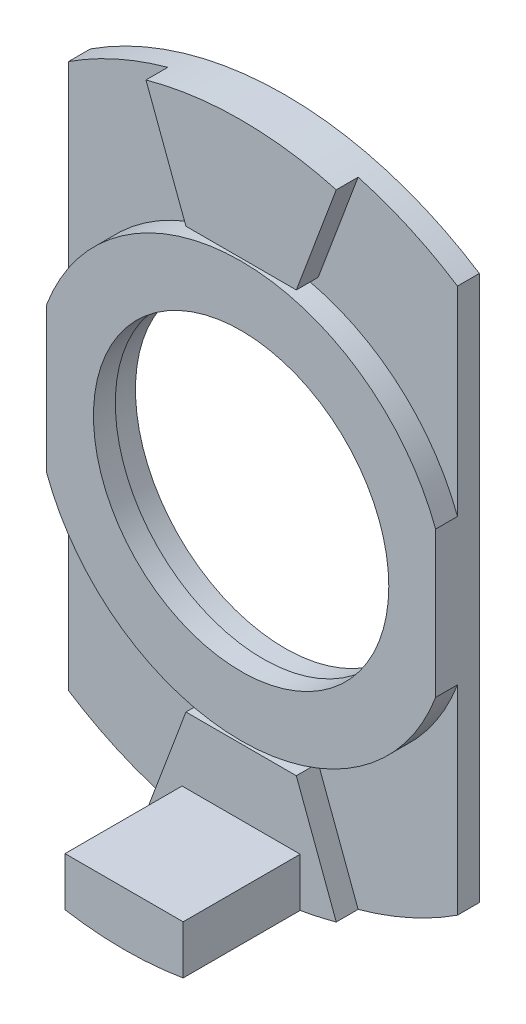
ISO-10303-21;
HEADER;
FILE_DESCRIPTION(('STEP AP214'),'2;1');
FILE_NAME('part.step','',(''),(''),'','','');
FILE_SCHEMA(('AUTOMOTIVE_DESIGN { 1 0 10303 214 1 1 1 1 }'));
ENDSEC;
DATA;
#1=APPLICATION_CONTEXT('core data for automotive mechanical design processes');
#2=APPLICATION_PROTOCOL_DEFINITION('international standard','automotive_design',2000,#1);
#3=PRODUCT_CONTEXT('',#1,'mechanical');
#4=PRODUCT('Part','Part','',(#3));
#5=PRODUCT_RELATED_PRODUCT_CATEGORY('part','',(#4));
#6=PRODUCT_DEFINITION_FORMATION('','',#4);
#7=PRODUCT_DEFINITION_CONTEXT('part definition',#1,'design');
#8=PRODUCT_DEFINITION('design','',#6,#7);
#9=PRODUCT_DEFINITION_SHAPE('','',#8);
#10=(LENGTH_UNIT() NAMED_UNIT(*) SI_UNIT(.MILLI.,.METRE.));
#11=(NAMED_UNIT(*) PLANE_ANGLE_UNIT() SI_UNIT($,.RADIAN.));
#12=(NAMED_UNIT(*) SI_UNIT($,.STERADIAN.) SOLID_ANGLE_UNIT());
#13=UNCERTAINTY_MEASURE_WITH_UNIT(LENGTH_MEASURE(1.E-05),#10,'distance_accuracy_value','');
#14=(GEOMETRIC_REPRESENTATION_CONTEXT(3) GLOBAL_UNCERTAINTY_ASSIGNED_CONTEXT((#13)) GLOBAL_UNIT_ASSIGNED_CONTEXT((#10,
#11,#12)) REPRESENTATION_CONTEXT('',''));
#15=CARTESIAN_POINT('',(0.,0.,0.));
#16=DIRECTION('',(0.,0.,1.));
#17=DIRECTION('',(1.,0.,0.));
#18=AXIS2_PLACEMENT_3D('',#15,#16,#17);
#19=CARTESIAN_POINT('',(0.,0.636052109545294,0.508));
#20=DIRECTION('',(0.,0.,-1.));
#21=DIRECTION('',(-1.,0.,0.));
#22=AXIS2_PLACEMENT_3D('',#19,#20,#21);
#23=PLANE('',#22);
#24=DIRECTION('',(-1.,0.,0.));
#25=VECTOR('',#24,1.);
#26=CARTESIAN_POINT('',(1.28140560740527,4.88403737082876,0.508));
#27=LINE('',#26,#25);
#28=CARTESIAN_POINT('',(1.28140560740527,4.88403737082876,0.508));
#29=VERTEX_POINT('',#28);
#30=CARTESIAN_POINT('',(-1.28140560740527,4.88403737082876,0.508));
#31=VERTEX_POINT('',#30);
#32=EDGE_CURVE('E47',#29,#31,#27,.T.);
#33=ORIENTED_EDGE('',*,*,#32,.T.);
#34=DIRECTION('',(-0.350658717365972,0.936503317631738,0.));
#35=VECTOR('',#34,1.);
#36=CARTESIAN_POINT('',(-2.20945708566231,7.36258202201928,0.508));
#37=LINE('',#36,#35);
#38=CARTESIAN_POINT('',(-2.20945708566231,7.36258202201928,0.508));
#39=VERTEX_POINT('',#38);
#40=EDGE_CURVE('E199',#31,#39,#37,.T.);
#41=ORIENTED_EDGE('',*,*,#40,.T.);
#42=CARTESIAN_POINT('',(0.,-0.636052109545295,0.508));
#43=DIRECTION('',(0.,0.,1.));
#44=DIRECTION('',(1.,0.,0.));
#45=AXIS2_PLACEMENT_3D('',#42,#43,#44);
#46=CIRCLE('',#45,8.29818345085315);
#47=CARTESIAN_POINT('',(-4.5160128225262,6.32566296439964,0.508));
#48=VERTEX_POINT('',#47);
#49=EDGE_CURVE('E176',#39,#48,#46,.T.);
#50=ORIENTED_EDGE('',*,*,#49,.T.);
#51=DIRECTION('',(0.,-1.,0.));
#52=VECTOR('',#51,1.);
#53=CARTESIAN_POINT('',(-4.5160128225262,6.32566296439964,0.508));
#54=LINE('',#53,#52);
#55=CARTESIAN_POINT('',(-4.5160128225262,1.69270465143286,0.508));
#56=VERTEX_POINT('',#55);
#57=EDGE_CURVE('E315',#48,#56,#54,.T.);
#58=ORIENTED_EDGE('',*,*,#57,.T.);
#59=CARTESIAN_POINT('',(0.,0.,0.508));
#60=DIRECTION('',(0.,0.,1.));
#61=DIRECTION('',(1.,0.,0.));
#62=AXIS2_PLACEMENT_3D('',#59,#60,#61);
#63=CIRCLE('',#62,4.82282291300474);
#64=CARTESIAN_POINT('',(4.5160128225262,1.69270465143286,0.508));
#65=VERTEX_POINT('',#64);
#66=EDGE_CURVE('E210',#65,#56,#63,.T.);
#67=ORIENTED_EDGE('',*,*,#66,.F.);
#68=DIRECTION('',(0.,1.,0.));
#69=VECTOR('',#68,1.);
#70=CARTESIAN_POINT('',(4.5160128225262,6.32566296439964,0.508));
#71=LINE('',#70,#69);
#72=CARTESIAN_POINT('',(4.5160128225262,6.32566296439964,0.508));
#73=VERTEX_POINT('',#72);
#74=EDGE_CURVE('E308',#65,#73,#71,.T.);
#75=ORIENTED_EDGE('',*,*,#74,.T.);
#76=CARTESIAN_POINT('',(2.20945708566231,7.36258202201928,0.508));
#77=VERTEX_POINT('',#76);
#78=EDGE_CURVE('E312',#73,#77,#46,.T.);
#79=ORIENTED_EDGE('',*,*,#78,.T.);
#80=DIRECTION('',(-0.350658717365972,-0.936503317631738,0.));
#81=VECTOR('',#80,1.);
#82=CARTESIAN_POINT('',(2.20945708566231,7.36258202201928,0.508));
#83=LINE('',#82,#81);
#84=EDGE_CURVE('E52',#77,#29,#83,.T.);
#85=ORIENTED_EDGE('',*,*,#84,.T.);
#86=EDGE_LOOP('',(#33,#41,#50,#58,#67,#75,#79,#85));
#87=FACE_BOUND('',#86,.T.);
#88=ADVANCED_FACE('F32',(#87),#23,.F.);
#89=CARTESIAN_POINT('',(0.,0.,0.508));
#90=DIRECTION('',(0.,0.,1.));
#91=DIRECTION('',(1.,0.,0.));
#92=AXIS2_PLACEMENT_3D('',#89,#90,#91);
#93=CIRCLE('',#92,4.82282291300474);
#94=CARTESIAN_POINT('',(-4.5160128225262,-1.69270465143286,0.508));
#95=VERTEX_POINT('',#94);
#96=CARTESIAN_POINT('',(4.5160128225262,-1.69270465143286,0.508));
#97=VERTEX_POINT('',#96);
#98=EDGE_CURVE('E217',#95,#97,#93,.T.);
#99=ORIENTED_EDGE('',*,*,#98,.F.);
#100=CARTESIAN_POINT('',(-4.5160128225262,-6.32566296439964,0.508));
#101=VERTEX_POINT('',#100);
#102=EDGE_CURVE('E314',#95,#101,#54,.T.);
#103=ORIENTED_EDGE('',*,*,#102,.T.);
#104=CARTESIAN_POINT('',(0.,0.636052109545294,0.508));
#105=DIRECTION('',(0.,0.,1.));
#106=DIRECTION('',(-1.,0.,0.));
#107=AXIS2_PLACEMENT_3D('',#104,#105,#106);
#108=CIRCLE('',#107,8.29818345085315);
#109=CARTESIAN_POINT('',(-2.20945708566231,-7.36258202201928,0.508));
#110=VERTEX_POINT('',#109);
#111=EDGE_CURVE('E306',#101,#110,#108,.T.);
#112=ORIENTED_EDGE('',*,*,#111,.T.);
#113=DIRECTION('',(-0.350658717365972,-0.936503317631738,0.));
#114=VECTOR('',#113,1.);
#115=CARTESIAN_POINT('',(-2.20945708566231,-7.36258202201928,0.508));
#116=LINE('',#115,#114);
#117=CARTESIAN_POINT('',(-1.28140560740527,-4.88403737082876,0.508));
#118=VERTEX_POINT('',#117);
#119=EDGE_CURVE('E288',#118,#110,#116,.T.);
#120=ORIENTED_EDGE('',*,*,#119,.F.);
#121=DIRECTION('',(-1.,0.,0.));
#122=VECTOR('',#121,1.);
#123=CARTESIAN_POINT('',(1.28140560740527,-4.88403737082876,0.508));
#124=LINE('',#123,#122);
#125=CARTESIAN_POINT('',(1.28140560740527,-4.88403737082876,0.508));
#126=VERTEX_POINT('',#125);
#127=EDGE_CURVE('E285',#126,#118,#124,.T.);
#128=ORIENTED_EDGE('',*,*,#127,.F.);
#129=DIRECTION('',(-0.350658717365972,0.936503317631738,0.));
#130=VECTOR('',#129,1.);
#131=CARTESIAN_POINT('',(2.20945708566231,-7.36258202201928,0.508));
#132=LINE('',#131,#130);
#133=CARTESIAN_POINT('',(2.20945708566231,-7.36258202201928,0.508));
#134=VERTEX_POINT('',#133);
#135=EDGE_CURVE('E272',#134,#126,#132,.T.);
#136=ORIENTED_EDGE('',*,*,#135,.F.);
#137=CARTESIAN_POINT('',(4.5160128225262,-6.32566296439964,0.508));
#138=VERTEX_POINT('',#137);
#139=EDGE_CURVE('E309',#134,#138,#108,.T.);
#140=ORIENTED_EDGE('',*,*,#139,.T.);
#141=EDGE_CURVE('E310',#138,#97,#71,.T.);
#142=ORIENTED_EDGE('',*,*,#141,.T.);
#143=EDGE_LOOP('',(#99,#103,#112,#120,#128,#136,#140,#142));
#144=FACE_BOUND('',#143,.T.);
#145=ADVANCED_FACE('F352',(#144),#23,.F.);
#146=CARTESIAN_POINT('',(0.,0.63605210954584,1.016));
#147=DIRECTION('',(0.,0.,-1.));
#148=DIRECTION('',(-1.,0.,0.));
#149=AXIS2_PLACEMENT_3D('',#146,#147,#148);
#150=PLANE('',#149);
#151=DIRECTION('',(0.,-1.,0.));
#152=VECTOR('',#151,1.);
#153=CARTESIAN_POINT('',(-1.3716,-7.54799102475044,1.016));
#154=LINE('',#153,#152);
#155=CARTESIAN_POINT('',(-1.3716,-6.41769102475044,1.016));
#156=VERTEX_POINT('',#155);
#157=CARTESIAN_POINT('',(-1.3716,-7.54799102475043,1.016));
#158=VERTEX_POINT('',#157);
#159=EDGE_CURVE('E247',#156,#158,#154,.T.);
#160=ORIENTED_EDGE('',*,*,#159,.F.);
#161=DIRECTION('',(-1.,0.,0.));
#162=VECTOR('',#161,1.);
#163=CARTESIAN_POINT('',(-1.3716,-6.41769102475044,1.016));
#164=LINE('',#163,#162);
#165=CARTESIAN_POINT('',(1.3716,-6.41769102475044,1.016));
#166=VERTEX_POINT('',#165);
#167=EDGE_CURVE('E256',#166,#156,#164,.T.);
#168=ORIENTED_EDGE('',*,*,#167,.F.);
#169=DIRECTION('',(0.,1.,0.));
#170=VECTOR('',#169,1.);
#171=CARTESIAN_POINT('',(1.3716,-6.41769102475044,1.016));
#172=LINE('',#171,#170);
#173=CARTESIAN_POINT('',(1.3716,-7.54799102475043,1.016));
#174=VERTEX_POINT('',#173);
#175=EDGE_CURVE('E242',#174,#166,#172,.T.);
#176=ORIENTED_EDGE('',*,*,#175,.F.);
#177=CARTESIAN_POINT('',(0.,0.63605210954584,1.016));
#178=DIRECTION('',(0.,0.,1.));
#179=DIRECTION('',(-1.,0.,0.));
#180=AXIS2_PLACEMENT_3D('',#177,#178,#179);
#181=CIRCLE('',#180,8.29818345085368);
#182=CARTESIAN_POINT('',(2.20945708566231,-7.36258202201928,1.016));
#183=VERTEX_POINT('',#182);
#184=EDGE_CURVE('E276',#174,#183,#181,.T.);
#185=ORIENTED_EDGE('',*,*,#184,.T.);
#186=DIRECTION('',(-0.350658717365972,0.936503317631738,0.));
#187=VECTOR('',#186,1.);
#188=CARTESIAN_POINT('',(2.20945708566231,-7.36258202201928,1.016));
#189=LINE('',#188,#187);
#190=CARTESIAN_POINT('',(1.28140560740527,-4.88403737082876,1.016));
#191=VERTEX_POINT('',#190);
#192=EDGE_CURVE('E275',#183,#191,#189,.T.);
#193=ORIENTED_EDGE('',*,*,#192,.T.);
#194=DIRECTION('',(-1.,0.,0.));
#195=VECTOR('',#194,1.);
#196=CARTESIAN_POINT('',(1.28140560740527,-4.88403737082876,1.016));
#197=LINE('',#196,#195);
#198=CARTESIAN_POINT('',(-1.28140560740527,-4.88403737082876,1.016));
#199=VERTEX_POINT('',#198);
#200=EDGE_CURVE('E278',#191,#199,#197,.T.);
#201=ORIENTED_EDGE('',*,*,#200,.T.);
#202=DIRECTION('',(-0.350658717365972,-0.936503317631738,0.));
#203=VECTOR('',#202,1.);
#204=CARTESIAN_POINT('',(-2.20945708566231,-7.36258202201928,1.016));
#205=LINE('',#204,#203);
#206=CARTESIAN_POINT('',(-2.20945708566231,-7.36258202201928,1.016));
#207=VERTEX_POINT('',#206);
#208=EDGE_CURVE('E280',#199,#207,#205,.T.);
#209=ORIENTED_EDGE('',*,*,#208,.T.);
#210=EDGE_CURVE('E273',#207,#158,#181,.T.);
#211=ORIENTED_EDGE('',*,*,#210,.T.);
#212=EDGE_LOOP('',(#160,#168,#176,#185,#193,#201,#209,#211));
#213=FACE_BOUND('',#212,.T.);
#214=ADVANCED_FACE('F404',(#213),#150,.F.);
#215=CARTESIAN_POINT('',(0.,0.636052109545294,0.));
#216=DIRECTION('',(0.,0.,-1.));
#217=DIRECTION('',(-1.,0.,0.));
#218=AXIS2_PLACEMENT_3D('',#215,#216,#217);
#219=PLANE('',#218);
#220=CARTESIAN_POINT('',(0.,0.636052109545294,0.));
#221=DIRECTION('',(0.,0.,1.));
#222=DIRECTION('',(-1.,0.,0.));
#223=AXIS2_PLACEMENT_3D('',#220,#221,#222);
#224=CIRCLE('',#223,8.29818345085315);
#225=CARTESIAN_POINT('',(-4.5160128225262,-6.32566296439964,0.));
#226=VERTEX_POINT('',#225);
#227=CARTESIAN_POINT('',(4.5160128225262,-6.32566296439964,0.));
#228=VERTEX_POINT('',#227);
#229=EDGE_CURVE('E305',#226,#228,#224,.T.);
#230=ORIENTED_EDGE('',*,*,#229,.F.);
#231=DIRECTION('',(0.,-1.,0.));
#232=VECTOR('',#231,1.);
#233=CARTESIAN_POINT('',(-4.5160128225262,6.32566296439964,0.));
#234=LINE('',#233,#232);
#235=CARTESIAN_POINT('',(-4.5160128225262,6.32566296439964,0.));
#236=VERTEX_POINT('',#235);
#237=EDGE_CURVE('E324',#236,#226,#234,.T.);
#238=ORIENTED_EDGE('',*,*,#237,.F.);
#239=CARTESIAN_POINT('',(0.,-0.636052109545295,0.));
#240=DIRECTION('',(0.,0.,1.));
#241=DIRECTION('',(1.,0.,0.));
#242=AXIS2_PLACEMENT_3D('',#239,#240,#241);
#243=CIRCLE('',#242,8.29818345085315);
#244=CARTESIAN_POINT('',(4.5160128225262,6.32566296439964,0.));
#245=VERTEX_POINT('',#244);
#246=EDGE_CURVE('E322',#245,#236,#243,.T.);
#247=ORIENTED_EDGE('',*,*,#246,.F.);
#248=DIRECTION('',(0.,1.,0.));
#249=VECTOR('',#248,1.);
#250=CARTESIAN_POINT('',(4.5160128225262,6.32566296439964,0.));
#251=LINE('',#250,#249);
#252=EDGE_CURVE('E320',#228,#245,#251,.T.);
#253=ORIENTED_EDGE('',*,*,#252,.F.);
#254=EDGE_LOOP('',(#230,#238,#247,#253));
#255=FACE_BOUND('',#254,.T.);
#256=CARTESIAN_POINT('',(0.,0.,0.));
#257=DIRECTION('',(0.,0.,1.));
#258=DIRECTION('',(1.,0.,0.));
#259=AXIS2_PLACEMENT_3D('',#256,#257,#258);
#260=CIRCLE('',#259,3.46997414662655);
#261=CARTESIAN_POINT('',(3.46997414662655,0.,0.));
#262=VERTEX_POINT('',#261);
#263=EDGE_CURVE('E302',#262,#262,#260,.T.);
#264=ORIENTED_EDGE('',*,*,#263,.T.);
#265=EDGE_LOOP('',(#264));
#266=FACE_BOUND('',#265,.T.);
#267=ADVANCED_FACE('F339',(#255,#266),#219,.T.);
#268=CARTESIAN_POINT('',(0.,0.636052109545294,0.508));
#269=DIRECTION('',(0.,0.,-1.));
#270=DIRECTION('',(-1.,0.,0.));
#271=AXIS2_PLACEMENT_3D('',#268,#269,#270);
#272=CYLINDRICAL_SURFACE('',#271,8.29818345085315);
#273=ORIENTED_EDGE('',*,*,#229,.T.);
#274=DIRECTION('',(0.,0.,-1.));
#275=VECTOR('',#274,1.);
#276=CARTESIAN_POINT('',(4.5160128225262,-6.32566296439964,0.508));
#277=LINE('',#276,#275);
#278=EDGE_CURVE('E11',#138,#228,#277,.T.);
#279=ORIENTED_EDGE('',*,*,#278,.F.);
#280=ORIENTED_EDGE('',*,*,#139,.F.);
#281=DIRECTION('',(0.,0.,-1.));
#282=VECTOR('',#281,1.);
#283=CARTESIAN_POINT('',(2.20945708566231,-7.36258202201928,1.016));
#284=LINE('',#283,#282);
#285=EDGE_CURVE('E299',#183,#134,#284,.T.);
#286=ORIENTED_EDGE('',*,*,#285,.F.);
#287=ORIENTED_EDGE('',*,*,#184,.F.);
#288=DIRECTION('',(0.,0.,-1.));
#289=VECTOR('',#288,1.);
#290=CARTESIAN_POINT('',(1.3716,-7.54799102475044,3.7338));
#291=LINE('',#290,#289);
#292=CARTESIAN_POINT('',(1.3716,-7.54799102475044,3.7338));
#293=VERTEX_POINT('',#292);
#294=EDGE_CURVE('E269',#293,#174,#291,.T.);
#295=ORIENTED_EDGE('',*,*,#294,.F.);
#296=CARTESIAN_POINT('',(0.,0.636052109545839,3.7338));
#297=DIRECTION('',(0.,0.,1.));
#298=DIRECTION('',(1.,0.,0.));
#299=AXIS2_PLACEMENT_3D('',#296,#297,#298);
#300=CIRCLE('',#299,8.29818345085368);
#301=CARTESIAN_POINT('',(-1.3716,-7.54799102475044,3.7338));
#302=VERTEX_POINT('',#301);
#303=EDGE_CURVE('E243',#302,#293,#300,.T.);
#304=ORIENTED_EDGE('',*,*,#303,.F.);
#305=DIRECTION('',(0.,0.,-1.));
#306=VECTOR('',#305,1.);
#307=CARTESIAN_POINT('',(-1.3716,-7.54799102475044,3.7338));
#308=LINE('',#307,#306);
#309=EDGE_CURVE('E253',#302,#158,#308,.T.);
#310=ORIENTED_EDGE('',*,*,#309,.T.);
#311=ORIENTED_EDGE('',*,*,#210,.F.);
#312=DIRECTION('',(0.,0.,-1.));
#313=VECTOR('',#312,1.);
#314=CARTESIAN_POINT('',(-2.20945708566231,-7.36258202201928,1.016));
#315=LINE('',#314,#313);
#316=EDGE_CURVE('E282',#207,#110,#315,.T.);
#317=ORIENTED_EDGE('',*,*,#316,.T.);
#318=ORIENTED_EDGE('',*,*,#111,.F.);
#319=DIRECTION('',(0.,0.,-1.));
#320=VECTOR('',#319,1.);
#321=CARTESIAN_POINT('',(-4.5160128225262,-6.32566296439964,0.508));
#322=LINE('',#321,#320);
#323=EDGE_CURVE('E317',#101,#226,#322,.T.);
#324=ORIENTED_EDGE('',*,*,#323,.T.);
#325=EDGE_LOOP('',(#273,#279,#280,#286,#287,#295,#304,#310,#311,#317,#318,#324));
#326=FACE_BOUND('',#325,.T.);
#327=ADVANCED_FACE('F34',(#326),#272,.T.);
#328=CARTESIAN_POINT('',(4.5160128225262,6.32566296439964,0.508));
#329=DIRECTION('',(-1.,0.,0.));
#330=DIRECTION('',(0.,-1.,0.));
#331=AXIS2_PLACEMENT_3D('',#328,#329,#330);
#332=PLANE('',#331);
#333=ORIENTED_EDGE('',*,*,#252,.T.);
#334=DIRECTION('',(0.,0.,-1.));
#335=VECTOR('',#334,1.);
#336=CARTESIAN_POINT('',(4.5160128225262,6.32566296439964,0.508));
#337=LINE('',#336,#335);
#338=EDGE_CURVE('E40',#73,#245,#337,.T.);
#339=ORIENTED_EDGE('',*,*,#338,.F.);
#340=ORIENTED_EDGE('',*,*,#74,.F.);
#341=DIRECTION('',(0.,0.,-1.));
#342=VECTOR('',#341,1.);
#343=CARTESIAN_POINT('',(4.5160128225262,1.69270465143286,1.016));
#344=LINE('',#343,#342);
#345=CARTESIAN_POINT('',(4.5160128225262,1.69270465143286,1.016));
#346=VERTEX_POINT('',#345);
#347=EDGE_CURVE('E223',#346,#65,#344,.T.);
#348=ORIENTED_EDGE('',*,*,#347,.F.);
#349=DIRECTION('',(0.,1.,0.));
#350=VECTOR('',#349,1.);
#351=CARTESIAN_POINT('',(4.5160128225262,-1.69270465143286,1.016));
#352=LINE('',#351,#350);
#353=CARTESIAN_POINT('',(4.5160128225262,-1.69270465143286,1.016));
#354=VERTEX_POINT('',#353);
#355=EDGE_CURVE('E221',#354,#346,#352,.T.);
#356=ORIENTED_EDGE('',*,*,#355,.F.);
#357=DIRECTION('',(0.,0.,-1.));
#358=VECTOR('',#357,1.);
#359=CARTESIAN_POINT('',(4.5160128225262,-1.69270465143286,1.016));
#360=LINE('',#359,#358);
#361=EDGE_CURVE('E230',#354,#97,#360,.T.);
#362=ORIENTED_EDGE('',*,*,#361,.T.);
#363=ORIENTED_EDGE('',*,*,#141,.F.);
#364=ORIENTED_EDGE('',*,*,#278,.T.);
#365=EDGE_LOOP('',(#333,#339,#340,#348,#356,#362,#363,#364));
#366=FACE_BOUND('',#365,.T.);
#367=ADVANCED_FACE('F369',(#366),#332,.F.);
#368=CARTESIAN_POINT('',(0.,-0.636052109545295,0.508));
#369=DIRECTION('',(0.,0.,-1.));
#370=DIRECTION('',(-1.,0.,0.));
#371=AXIS2_PLACEMENT_3D('',#368,#369,#370);
#372=CYLINDRICAL_SURFACE('',#371,8.29818345085315);
#373=ORIENTED_EDGE('',*,*,#246,.T.);
#374=DIRECTION('',(0.,0.,-1.));
#375=VECTOR('',#374,1.);
#376=CARTESIAN_POINT('',(-4.5160128225262,6.32566296439964,0.508));
#377=LINE('',#376,#375);
#378=EDGE_CURVE('E328',#48,#236,#377,.T.);
#379=ORIENTED_EDGE('',*,*,#378,.F.);
#380=ORIENTED_EDGE('',*,*,#49,.F.);
#381=DIRECTION('',(0.,0.,-1.));
#382=VECTOR('',#381,1.);
#383=CARTESIAN_POINT('',(-2.20945708566231,7.36258202201928,1.016));
#384=LINE('',#383,#382);
#385=CARTESIAN_POINT('',(-2.20945708566231,7.36258202201928,1.016));
#386=VERTEX_POINT('',#385);
#387=EDGE_CURVE('E169',#386,#39,#384,.T.);
#388=ORIENTED_EDGE('',*,*,#387,.F.);
#389=CARTESIAN_POINT('',(0.,-0.63605210954584,1.016));
#390=DIRECTION('',(0.,0.,-1.));
#391=DIRECTION('',(-1.,0.,0.));
#392=AXIS2_PLACEMENT_3D('',#389,#390,#391);
#393=CIRCLE('',#392,8.29818345085368);
#394=CARTESIAN_POINT('',(2.20945708566231,7.36258202201928,1.016));
#395=VERTEX_POINT('',#394);
#396=EDGE_CURVE('E173',#386,#395,#393,.T.);
#397=ORIENTED_EDGE('',*,*,#396,.T.);
#398=DIRECTION('',(0.,0.,-1.));
#399=VECTOR('',#398,1.);
#400=CARTESIAN_POINT('',(2.20945708566231,7.36258202201928,1.016));
#401=LINE('',#400,#399);
#402=EDGE_CURVE('E198',#395,#77,#401,.T.);
#403=ORIENTED_EDGE('',*,*,#402,.T.);
#404=ORIENTED_EDGE('',*,*,#78,.F.);
#405=ORIENTED_EDGE('',*,*,#338,.T.);
#406=EDGE_LOOP('',(#373,#379,#380,#388,#397,#403,#404,#405));
#407=FACE_BOUND('',#406,.T.);
#408=ADVANCED_FACE('F171',(#407),#372,.T.);
#409=CARTESIAN_POINT('',(-4.5160128225262,6.32566296439964,0.508));
#410=DIRECTION('',(1.,0.,0.));
#411=DIRECTION('',(0.,0.,-1.));
#412=AXIS2_PLACEMENT_3D('',#409,#410,#411);
#413=PLANE('',#412);
#414=ORIENTED_EDGE('',*,*,#237,.T.);
#415=ORIENTED_EDGE('',*,*,#323,.F.);
#416=ORIENTED_EDGE('',*,*,#102,.F.);
#417=DIRECTION('',(0.,0.,-1.));
#418=VECTOR('',#417,1.);
#419=CARTESIAN_POINT('',(-4.5160128225262,-1.69270465143286,1.016));
#420=LINE('',#419,#418);
#421=CARTESIAN_POINT('',(-4.5160128225262,-1.69270465143286,1.016));
#422=VERTEX_POINT('',#421);
#423=EDGE_CURVE('E233',#422,#95,#420,.T.);
#424=ORIENTED_EDGE('',*,*,#423,.F.);
#425=DIRECTION('',(0.,-1.,0.));
#426=VECTOR('',#425,1.);
#427=CARTESIAN_POINT('',(-4.5160128225262,1.69270465143286,1.016));
#428=LINE('',#427,#426);
#429=CARTESIAN_POINT('',(-4.5160128225262,1.69270465143286,1.016));
#430=VERTEX_POINT('',#429);
#431=EDGE_CURVE('E216',#430,#422,#428,.T.);
#432=ORIENTED_EDGE('',*,*,#431,.F.);
#433=DIRECTION('',(0.,0.,-1.));
#434=VECTOR('',#433,1.);
#435=CARTESIAN_POINT('',(-4.5160128225262,1.69270465143286,1.016));
#436=LINE('',#435,#434);
#437=EDGE_CURVE('E236',#430,#56,#436,.T.);
#438=ORIENTED_EDGE('',*,*,#437,.T.);
#439=ORIENTED_EDGE('',*,*,#57,.F.);
#440=ORIENTED_EDGE('',*,*,#378,.T.);
#441=EDGE_LOOP('',(#414,#415,#416,#424,#432,#438,#439,#440));
#442=FACE_BOUND('',#441,.T.);
#443=ADVANCED_FACE('F343',(#442),#413,.F.);
#444=CARTESIAN_POINT('',(0.,0.,0.508));
#445=DIRECTION('',(0.,0.,-1.));
#446=DIRECTION('',(-1.,0.,0.));
#447=AXIS2_PLACEMENT_3D('',#444,#445,#446);
#448=CYLINDRICAL_SURFACE('',#447,3.46997414662655);
#449=CARTESIAN_POINT('',(0.,0.,0.508));
#450=DIRECTION('',(0.,0.,1.));
#451=DIRECTION('',(1.,0.,0.));
#452=AXIS2_PLACEMENT_3D('',#449,#450,#451);
#453=CIRCLE('',#452,3.46997414662655);
#454=CARTESIAN_POINT('',(3.46997414662655,0.,0.508));
#455=VERTEX_POINT('',#454);
#456=EDGE_CURVE('E239',#455,#455,#453,.T.);
#457=ORIENTED_EDGE('',*,*,#456,.T.);
#458=EDGE_LOOP('',(#457));
#459=FACE_BOUND('',#458,.T.);
#460=ORIENTED_EDGE('',*,*,#263,.F.);
#461=EDGE_LOOP('',(#460));
#462=FACE_BOUND('',#461,.T.);
#463=ADVANCED_FACE('F407',(#459,#462),#448,.F.);
#464=CARTESIAN_POINT('',(2.20945708566231,-7.36258202201928,1.016));
#465=DIRECTION('',(-0.936503317631738,-0.350658717365972,0.));
#466=DIRECTION('',(0.350658717365972,-0.936503317631738,0.));
#467=AXIS2_PLACEMENT_3D('',#464,#465,#466);
#468=PLANE('',#467);
#469=ORIENTED_EDGE('',*,*,#135,.T.);
#470=DIRECTION('',(0.,0.,-1.));
#471=VECTOR('',#470,1.);
#472=CARTESIAN_POINT('',(1.28140560740527,-4.88403737082876,1.016));
#473=LINE('',#472,#471);
#474=EDGE_CURVE('E296',#191,#126,#473,.T.);
#475=ORIENTED_EDGE('',*,*,#474,.F.);
#476=ORIENTED_EDGE('',*,*,#192,.F.);
#477=ORIENTED_EDGE('',*,*,#285,.T.);
#478=EDGE_LOOP('',(#469,#475,#476,#477));
#479=FACE_BOUND('',#478,.T.);
#480=ADVANCED_FACE('F363',(#479),#468,.F.);
#481=CARTESIAN_POINT('',(1.28140560740527,-4.88403737082876,1.016));
#482=DIRECTION('',(0.,-1.,0.));
#483=DIRECTION('',(0.,0.,-1.));
#484=AXIS2_PLACEMENT_3D('',#481,#482,#483);
#485=PLANE('',#484);
#486=ORIENTED_EDGE('',*,*,#127,.T.);
#487=DIRECTION('',(0.,0.,-1.));
#488=VECTOR('',#487,1.);
#489=CARTESIAN_POINT('',(-1.28140560740527,-4.88403737082876,1.016));
#490=LINE('',#489,#488);
#491=EDGE_CURVE('E293',#199,#118,#490,.T.);
#492=ORIENTED_EDGE('',*,*,#491,.F.);
#493=ORIENTED_EDGE('',*,*,#200,.F.);
#494=ORIENTED_EDGE('',*,*,#474,.T.);
#495=EDGE_LOOP('',(#486,#492,#493,#494));
#496=FACE_BOUND('',#495,.T.);
#497=ADVANCED_FACE('F359',(#496),#485,.F.);
#498=CARTESIAN_POINT('',(-2.20945708566231,-7.36258202201928,1.016));
#499=DIRECTION('',(0.936503317631738,-0.350658717365972,0.));
#500=DIRECTION('',(0.350658717365972,0.936503317631738,0.));
#501=AXIS2_PLACEMENT_3D('',#498,#499,#500);
#502=PLANE('',#501);
#503=ORIENTED_EDGE('',*,*,#119,.T.);
#504=ORIENTED_EDGE('',*,*,#316,.F.);
#505=ORIENTED_EDGE('',*,*,#208,.F.);
#506=ORIENTED_EDGE('',*,*,#491,.T.);
#507=EDGE_LOOP('',(#503,#504,#505,#506));
#508=FACE_BOUND('',#507,.T.);
#509=ADVANCED_FACE('F354',(#508),#502,.F.);
#510=CARTESIAN_POINT('',(1.3716,-6.41769102475044,3.7338));
#511=DIRECTION('',(-1.,0.,0.));
#512=DIRECTION('',(0.,0.,1.));
#513=AXIS2_PLACEMENT_3D('',#510,#511,#512);
#514=PLANE('',#513);
#515=ORIENTED_EDGE('',*,*,#175,.T.);
#516=DIRECTION('',(0.,0.,-1.));
#517=VECTOR('',#516,1.);
#518=CARTESIAN_POINT('',(1.3716,-6.41769102475044,3.7338));
#519=LINE('',#518,#517);
#520=CARTESIAN_POINT('',(1.3716,-6.41769102475044,3.7338));
#521=VERTEX_POINT('',#520);
#522=EDGE_CURVE('E266',#521,#166,#519,.T.);
#523=ORIENTED_EDGE('',*,*,#522,.F.);
#524=DIRECTION('',(0.,1.,0.));
#525=VECTOR('',#524,1.);
#526=CARTESIAN_POINT('',(1.3716,-6.41769102475044,3.7338));
#527=LINE('',#526,#525);
#528=EDGE_CURVE('E246',#293,#521,#527,.T.);
#529=ORIENTED_EDGE('',*,*,#528,.F.);
#530=ORIENTED_EDGE('',*,*,#294,.T.);
#531=EDGE_LOOP('',(#515,#523,#529,#530));
#532=FACE_BOUND('',#531,.T.);
#533=ADVANCED_FACE('F449',(#532),#514,.F.);
#534=CARTESIAN_POINT('',(-1.3716,-6.41769102475044,3.7338));
#535=DIRECTION('',(0.,-1.,0.));
#536=DIRECTION('',(0.,0.,-1.));
#537=AXIS2_PLACEMENT_3D('',#534,#535,#536);
#538=PLANE('',#537);
#539=ORIENTED_EDGE('',*,*,#167,.T.);
#540=DIRECTION('',(0.,0.,-1.));
#541=VECTOR('',#540,1.);
#542=CARTESIAN_POINT('',(-1.3716,-6.41769102475044,3.7338));
#543=LINE('',#542,#541);
#544=CARTESIAN_POINT('',(-1.3716,-6.41769102475044,3.7338));
#545=VERTEX_POINT('',#544);
#546=EDGE_CURVE('E263',#545,#156,#543,.T.);
#547=ORIENTED_EDGE('',*,*,#546,.F.);
#548=DIRECTION('',(-1.,0.,0.));
#549=VECTOR('',#548,1.);
#550=CARTESIAN_POINT('',(-1.3716,-6.41769102475044,3.7338));
#551=LINE('',#550,#549);
#552=EDGE_CURVE('E249',#521,#545,#551,.T.);
#553=ORIENTED_EDGE('',*,*,#552,.F.);
#554=ORIENTED_EDGE('',*,*,#522,.T.);
#555=EDGE_LOOP('',(#539,#547,#553,#554));
#556=FACE_BOUND('',#555,.T.);
#557=ADVANCED_FACE('F455',(#556),#538,.F.);
#558=CARTESIAN_POINT('',(-1.3716,-7.54799102475044,3.7338));
#559=DIRECTION('',(1.,0.,0.));
#560=DIRECTION('',(0.,0.,-1.));
#561=AXIS2_PLACEMENT_3D('',#558,#559,#560);
#562=PLANE('',#561);
#563=ORIENTED_EDGE('',*,*,#159,.T.);
#564=ORIENTED_EDGE('',*,*,#309,.F.);
#565=DIRECTION('',(0.,-1.,0.));
#566=VECTOR('',#565,1.);
#567=CARTESIAN_POINT('',(-1.3716,-7.54799102475044,3.7338));
#568=LINE('',#567,#566);
#569=EDGE_CURVE('E251',#545,#302,#568,.T.);
#570=ORIENTED_EDGE('',*,*,#569,.F.);
#571=ORIENTED_EDGE('',*,*,#546,.T.);
#572=EDGE_LOOP('',(#563,#564,#570,#571));
#573=FACE_BOUND('',#572,.T.);
#574=ADVANCED_FACE('F463',(#573),#562,.F.);
#575=CARTESIAN_POINT('',(0.,0.636052109545839,3.7338));
#576=DIRECTION('',(0.,0.,1.));
#577=DIRECTION('',(1.,0.,0.));
#578=AXIS2_PLACEMENT_3D('',#575,#576,#577);
#579=PLANE('',#578);
#580=ORIENTED_EDGE('',*,*,#303,.T.);
#581=ORIENTED_EDGE('',*,*,#528,.T.);
#582=ORIENTED_EDGE('',*,*,#552,.T.);
#583=ORIENTED_EDGE('',*,*,#569,.T.);
#584=EDGE_LOOP('',(#580,#581,#582,#583));
#585=FACE_BOUND('',#584,.T.);
#586=ADVANCED_FACE('F471',(#585),#579,.T.);
#587=CARTESIAN_POINT('',(0.,0.,0.508));
#588=DIRECTION('',(0.,0.,1.));
#589=DIRECTION('',(1.,0.,0.));
#590=AXIS2_PLACEMENT_3D('',#587,#588,#589);
#591=PLANE('',#590);
#592=CARTESIAN_POINT('',(0.,0.,0.508));
#593=DIRECTION('',(0.,0.,1.));
#594=DIRECTION('',(1.,0.,0.));
#595=AXIS2_PLACEMENT_3D('',#592,#593,#594);
#596=CIRCLE('',#595,3.429);
#597=CARTESIAN_POINT('',(3.429,0.,0.508));
#598=VERTEX_POINT('',#597);
#599=EDGE_CURVE('E180',#598,#598,#596,.T.);
#600=ORIENTED_EDGE('',*,*,#599,.T.);
#601=EDGE_LOOP('',(#600));
#602=FACE_BOUND('',#601,.T.);
#603=ORIENTED_EDGE('',*,*,#456,.F.);
#604=EDGE_LOOP('',(#603));
#605=FACE_BOUND('',#604,.T.);
#606=ADVANCED_FACE('F479',(#602,#605),#591,.F.);
#607=CARTESIAN_POINT('',(0.,0.,1.016));
#608=DIRECTION('',(0.,0.,1.));
#609=DIRECTION('',(1.,0.,0.));
#610=AXIS2_PLACEMENT_3D('',#607,#608,#609);
#611=PLANE('',#610);
#612=CARTESIAN_POINT('',(0.,0.,1.016));
#613=DIRECTION('',(0.,0.,1.));
#614=DIRECTION('',(1.,0.,0.));
#615=AXIS2_PLACEMENT_3D('',#612,#613,#614);
#616=CIRCLE('',#615,4.82282291300474);
#617=EDGE_CURVE('E213',#346,#430,#616,.T.);
#618=ORIENTED_EDGE('',*,*,#617,.T.);
#619=ORIENTED_EDGE('',*,*,#431,.T.);
#620=CARTESIAN_POINT('',(0.,0.,1.016));
#621=DIRECTION('',(0.,0.,1.));
#622=DIRECTION('',(1.,0.,0.));
#623=AXIS2_PLACEMENT_3D('',#620,#621,#622);
#624=CIRCLE('',#623,4.82282291300474);
#625=EDGE_CURVE('E219',#422,#354,#624,.T.);
#626=ORIENTED_EDGE('',*,*,#625,.T.);
#627=ORIENTED_EDGE('',*,*,#355,.T.);
#628=EDGE_LOOP('',(#618,#619,#626,#627));
#629=FACE_BOUND('',#628,.T.);
#630=CARTESIAN_POINT('',(0.,0.,1.016));
#631=DIRECTION('',(0.,0.,1.));
#632=DIRECTION('',(1.,0.,0.));
#633=AXIS2_PLACEMENT_3D('',#630,#631,#632);
#634=CIRCLE('',#633,3.429);
#635=CARTESIAN_POINT('',(3.429,0.,1.016));
#636=VERTEX_POINT('',#635);
#637=EDGE_CURVE('E207',#636,#636,#634,.T.);
#638=ORIENTED_EDGE('',*,*,#637,.F.);
#639=EDGE_LOOP('',(#638));
#640=FACE_BOUND('',#639,.T.);
#641=ADVANCED_FACE('F380',(#629,#640),#611,.T.);
#642=CARTESIAN_POINT('',(0.,0.,1.016));
#643=DIRECTION('',(0.,0.,-1.));
#644=DIRECTION('',(-1.,0.,0.));
#645=AXIS2_PLACEMENT_3D('',#642,#643,#644);
#646=CYLINDRICAL_SURFACE('',#645,4.82282291300474);
#647=ORIENTED_EDGE('',*,*,#66,.T.);
#648=ORIENTED_EDGE('',*,*,#437,.F.);
#649=ORIENTED_EDGE('',*,*,#617,.F.);
#650=ORIENTED_EDGE('',*,*,#347,.T.);
#651=EDGE_LOOP('',(#647,#648,#649,#650));
#652=FACE_BOUND('',#651,.T.);
#653=ADVANCED_FACE('F383',(#652),#646,.T.);
#654=CARTESIAN_POINT('',(0.,0.,1.016));
#655=DIRECTION('',(0.,0.,-1.));
#656=DIRECTION('',(-1.,0.,0.));
#657=AXIS2_PLACEMENT_3D('',#654,#655,#656);
#658=CYLINDRICAL_SURFACE('',#657,4.82282291300474);
#659=ORIENTED_EDGE('',*,*,#98,.T.);
#660=ORIENTED_EDGE('',*,*,#361,.F.);
#661=ORIENTED_EDGE('',*,*,#625,.F.);
#662=ORIENTED_EDGE('',*,*,#423,.T.);
#663=EDGE_LOOP('',(#659,#660,#661,#662));
#664=FACE_BOUND('',#663,.T.);
#665=ADVANCED_FACE('F375',(#664),#658,.T.);
#666=CARTESIAN_POINT('',(0.,0.,1.016));
#667=DIRECTION('',(0.,0.,-1.));
#668=DIRECTION('',(-1.,0.,0.));
#669=AXIS2_PLACEMENT_3D('',#666,#667,#668);
#670=CYLINDRICAL_SURFACE('',#669,3.429);
#671=ORIENTED_EDGE('',*,*,#637,.T.);
#672=EDGE_LOOP('',(#671));
#673=FACE_BOUND('',#672,.T.);
#674=ORIENTED_EDGE('',*,*,#599,.F.);
#675=EDGE_LOOP('',(#674));
#676=FACE_BOUND('',#675,.T.);
#677=ADVANCED_FACE('F395',(#673,#676),#670,.F.);
#678=CARTESIAN_POINT('',(-2.20945708566231,7.36258202201928,1.016));
#679=DIRECTION('',(-0.936503317631738,-0.350658717365972,0.));
#680=DIRECTION('',(0.350658717365972,-0.936503317631738,0.));
#681=AXIS2_PLACEMENT_3D('',#678,#679,#680);
#682=PLANE('',#681);
#683=ORIENTED_EDGE('',*,*,#40,.F.);
#684=DIRECTION('',(0.,0.,-1.));
#685=VECTOR('',#684,1.);
#686=CARTESIAN_POINT('',(-1.28140560740527,4.88403737082876,1.016));
#687=LINE('',#686,#685);
#688=CARTESIAN_POINT('',(-1.28140560740527,4.88403737082876,1.016));
#689=VERTEX_POINT('',#688);
#690=EDGE_CURVE('E181',#689,#31,#687,.T.);
#691=ORIENTED_EDGE('',*,*,#690,.F.);
#692=DIRECTION('',(-0.350658717365972,0.936503317631738,0.));
#693=VECTOR('',#692,1.);
#694=CARTESIAN_POINT('',(-2.20945708566231,7.36258202201928,1.016));
#695=LINE('',#694,#693);
#696=EDGE_CURVE('E187',#689,#386,#695,.T.);
#697=ORIENTED_EDGE('',*,*,#696,.T.);
#698=ORIENTED_EDGE('',*,*,#387,.T.);
#699=EDGE_LOOP('',(#683,#691,#697,#698));
#700=FACE_BOUND('',#699,.T.);
#701=ADVANCED_FACE('F192',(#700),#682,.T.);
#702=CARTESIAN_POINT('',(1.28140560740527,4.88403737082876,1.016));
#703=DIRECTION('',(0.,-1.,0.));
#704=DIRECTION('',(0.,0.,-1.));
#705=AXIS2_PLACEMENT_3D('',#702,#703,#704);
#706=PLANE('',#705);
#707=ORIENTED_EDGE('',*,*,#32,.F.);
#708=DIRECTION('',(0.,0.,-1.));
#709=VECTOR('',#708,1.);
#710=CARTESIAN_POINT('',(1.28140560740527,4.88403737082876,1.016));
#711=LINE('',#710,#709);
#712=CARTESIAN_POINT('',(1.28140560740527,4.88403737082876,1.016));
#713=VERTEX_POINT('',#712);
#714=EDGE_CURVE('E204',#713,#29,#711,.T.);
#715=ORIENTED_EDGE('',*,*,#714,.F.);
#716=DIRECTION('',(-1.,0.,0.));
#717=VECTOR('',#716,1.);
#718=CARTESIAN_POINT('',(1.28140560740527,4.88403737082876,1.016));
#719=LINE('',#718,#717);
#720=EDGE_CURVE('E193',#713,#689,#719,.T.);
#721=ORIENTED_EDGE('',*,*,#720,.T.);
#722=ORIENTED_EDGE('',*,*,#690,.T.);
#723=EDGE_LOOP('',(#707,#715,#721,#722));
#724=FACE_BOUND('',#723,.T.);
#725=ADVANCED_FACE('F387',(#724),#706,.T.);
#726=CARTESIAN_POINT('',(2.20945708566231,7.36258202201928,1.016));
#727=DIRECTION('',(0.936503317631738,-0.350658717365972,0.));
#728=DIRECTION('',(0.350658717365972,0.936503317631738,0.));
#729=AXIS2_PLACEMENT_3D('',#726,#727,#728);
#730=PLANE('',#729);
#731=ORIENTED_EDGE('',*,*,#84,.F.);
#732=ORIENTED_EDGE('',*,*,#402,.F.);
#733=DIRECTION('',(-0.350658717365972,-0.936503317631738,0.));
#734=VECTOR('',#733,1.);
#735=CARTESIAN_POINT('',(2.20945708566231,7.36258202201928,1.016));
#736=LINE('',#735,#734);
#737=EDGE_CURVE('E190',#395,#713,#736,.T.);
#738=ORIENTED_EDGE('',*,*,#737,.T.);
#739=ORIENTED_EDGE('',*,*,#714,.T.);
#740=EDGE_LOOP('',(#731,#732,#738,#739));
#741=FACE_BOUND('',#740,.T.);
#742=ADVANCED_FACE('F385',(#741),#730,.T.);
#743=CARTESIAN_POINT('',(0.,-0.63605210954584,1.016));
#744=DIRECTION('',(0.,0.,-1.));
#745=DIRECTION('',(-1.,0.,0.));
#746=AXIS2_PLACEMENT_3D('',#743,#744,#745);
#747=PLANE('',#746);
#748=ORIENTED_EDGE('',*,*,#396,.F.);
#749=ORIENTED_EDGE('',*,*,#696,.F.);
#750=ORIENTED_EDGE('',*,*,#720,.F.);
#751=ORIENTED_EDGE('',*,*,#737,.F.);
#752=EDGE_LOOP('',(#748,#749,#750,#751));
#753=FACE_BOUND('',#752,.T.);
#754=ADVANCED_FACE('F185',(#753),#747,.F.);
#755=CLOSED_SHELL('',(#88,#145,#214,#267,#327,#367,#408,#443,#463,#480,#497,#509,#533,#557,#574,
#586,#606,#641,#653,#665,#677,#701,#725,#742,#754));
#756=MANIFOLD_SOLID_BREP('B2',#755);
#757=ADVANCED_BREP_SHAPE_REPRESENTATION('',(#18,#756),#14);
#758=SHAPE_DEFINITION_REPRESENTATION(#9,#757);
ENDSEC;
END-ISO-10303-21;
